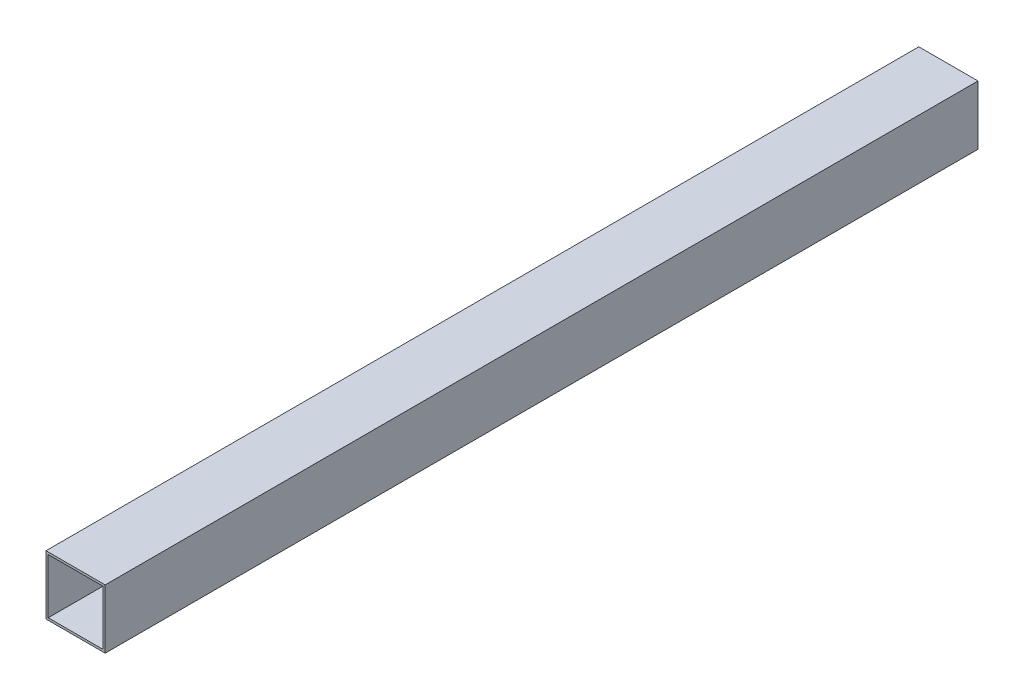
ISO-10303-21;
HEADER;
FILE_DESCRIPTION(('STEP AP214'),'2;1');
FILE_NAME('part.step','',(''),(''),'','','');
FILE_SCHEMA(('AUTOMOTIVE_DESIGN { 1 0 10303 214 1 1 1 1 }'));
ENDSEC;
DATA;
#1=APPLICATION_CONTEXT('core data for automotive mechanical design processes');
#2=APPLICATION_PROTOCOL_DEFINITION('international standard','automotive_design',2000,#1);
#3=PRODUCT_CONTEXT('',#1,'mechanical');
#4=PRODUCT('Part','Part','',(#3));
#5=PRODUCT_RELATED_PRODUCT_CATEGORY('part','',(#4));
#6=PRODUCT_DEFINITION_FORMATION('','',#4);
#7=PRODUCT_DEFINITION_CONTEXT('part definition',#1,'design');
#8=PRODUCT_DEFINITION('design','',#6,#7);
#9=PRODUCT_DEFINITION_SHAPE('','',#8);
#10=(LENGTH_UNIT() NAMED_UNIT(*) SI_UNIT(.MILLI.,.METRE.));
#11=(NAMED_UNIT(*) PLANE_ANGLE_UNIT() SI_UNIT($,.RADIAN.));
#12=(NAMED_UNIT(*) SI_UNIT($,.STERADIAN.) SOLID_ANGLE_UNIT());
#13=UNCERTAINTY_MEASURE_WITH_UNIT(LENGTH_MEASURE(1.E-05),#10,'distance_accuracy_value','');
#14=(GEOMETRIC_REPRESENTATION_CONTEXT(3) GLOBAL_UNCERTAINTY_ASSIGNED_CONTEXT((#13)) GLOBAL_UNIT_ASSIGNED_CONTEXT((#10,
#11,#12)) REPRESENTATION_CONTEXT('',''));
#15=CARTESIAN_POINT('',(0.,0.,0.));
#16=DIRECTION('',(0.,0.,1.));
#17=DIRECTION('',(1.,0.,0.));
#18=AXIS2_PLACEMENT_3D('',#15,#16,#17);
#19=CARTESIAN_POINT('',(20.,-20.,590.));
#20=DIRECTION('',(-1.,0.,0.));
#21=DIRECTION('',(0.,0.,1.));
#22=AXIS2_PLACEMENT_3D('',#19,#20,#21);
#23=PLANE('',#22);
#24=DIRECTION('',(0.,1.,0.));
#25=VECTOR('',#24,1.);
#26=CARTESIAN_POINT('',(20.,-20.,0.));
#27=LINE('',#26,#25);
#28=CARTESIAN_POINT('',(20.,-20.,0.));
#29=VERTEX_POINT('',#28);
#30=CARTESIAN_POINT('',(20.,20.,0.));
#31=VERTEX_POINT('',#30);
#32=EDGE_CURVE('E147',#29,#31,#27,.T.);
#33=ORIENTED_EDGE('',*,*,#32,.T.);
#34=DIRECTION('',(0.,0.,-1.));
#35=VECTOR('',#34,1.);
#36=CARTESIAN_POINT('',(20.,20.,590.));
#37=LINE('',#36,#35);
#38=CARTESIAN_POINT('',(20.,20.,590.));
#39=VERTEX_POINT('',#38);
#40=EDGE_CURVE('E11',#39,#31,#37,.T.);
#41=ORIENTED_EDGE('',*,*,#40,.F.);
#42=DIRECTION('',(0.,1.,0.));
#43=VECTOR('',#42,1.);
#44=CARTESIAN_POINT('',(20.,-20.,590.));
#45=LINE('',#44,#43);
#46=CARTESIAN_POINT('',(20.,-20.,590.));
#47=VERTEX_POINT('',#46);
#48=EDGE_CURVE('E153',#47,#39,#45,.T.);
#49=ORIENTED_EDGE('',*,*,#48,.F.);
#50=DIRECTION('',(0.,0.,-1.));
#51=VECTOR('',#50,1.);
#52=CARTESIAN_POINT('',(20.,-20.,590.));
#53=LINE('',#52,#51);
#54=EDGE_CURVE('E167',#47,#29,#53,.T.);
#55=ORIENTED_EDGE('',*,*,#54,.T.);
#56=EDGE_LOOP('',(#33,#41,#49,#55));
#57=FACE_BOUND('',#56,.T.);
#58=ADVANCED_FACE('F39',(#57),#23,.F.);
#59=CARTESIAN_POINT('',(-20.,20.,590.));
#60=DIRECTION('',(0.,-1.,0.));
#61=DIRECTION('',(0.,0.,-1.));
#62=AXIS2_PLACEMENT_3D('',#59,#60,#61);
#63=PLANE('',#62);
#64=DIRECTION('',(-1.,0.,0.));
#65=VECTOR('',#64,1.);
#66=CARTESIAN_POINT('',(-20.,20.,0.));
#67=LINE('',#66,#65);
#68=CARTESIAN_POINT('',(-20.,20.,0.));
#69=VERTEX_POINT('',#68);
#70=EDGE_CURVE('E171',#31,#69,#67,.T.);
#71=ORIENTED_EDGE('',*,*,#70,.T.);
#72=DIRECTION('',(0.,0.,-1.));
#73=VECTOR('',#72,1.);
#74=CARTESIAN_POINT('',(-20.,20.,590.));
#75=LINE('',#74,#73);
#76=CARTESIAN_POINT('',(-20.,20.,590.));
#77=VERTEX_POINT('',#76);
#78=EDGE_CURVE('E47',#77,#69,#75,.T.);
#79=ORIENTED_EDGE('',*,*,#78,.F.);
#80=DIRECTION('',(-1.,0.,0.));
#81=VECTOR('',#80,1.);
#82=CARTESIAN_POINT('',(-20.,20.,590.));
#83=LINE('',#82,#81);
#84=EDGE_CURVE('E157',#39,#77,#83,.T.);
#85=ORIENTED_EDGE('',*,*,#84,.F.);
#86=ORIENTED_EDGE('',*,*,#40,.T.);
#87=EDGE_LOOP('',(#71,#79,#85,#86));
#88=FACE_BOUND('',#87,.T.);
#89=ADVANCED_FACE('F205',(#88),#63,.F.);
#90=CARTESIAN_POINT('',(-20.,-20.,590.));
#91=DIRECTION('',(1.,0.,0.));
#92=DIRECTION('',(0.,0.,-1.));
#93=AXIS2_PLACEMENT_3D('',#90,#91,#92);
#94=PLANE('',#93);
#95=DIRECTION('',(0.,-1.,0.));
#96=VECTOR('',#95,1.);
#97=CARTESIAN_POINT('',(-20.,-20.,0.));
#98=LINE('',#97,#96);
#99=CARTESIAN_POINT('',(-20.,-20.,0.));
#100=VERTEX_POINT('',#99);
#101=EDGE_CURVE('E174',#69,#100,#98,.T.);
#102=ORIENTED_EDGE('',*,*,#101,.T.);
#103=DIRECTION('',(0.,0.,-1.));
#104=VECTOR('',#103,1.);
#105=CARTESIAN_POINT('',(-20.,-20.,590.));
#106=LINE('',#105,#104);
#107=CARTESIAN_POINT('',(-20.,-20.,590.));
#108=VERTEX_POINT('',#107);
#109=EDGE_CURVE('E182',#108,#100,#106,.T.);
#110=ORIENTED_EDGE('',*,*,#109,.F.);
#111=DIRECTION('',(0.,-1.,0.));
#112=VECTOR('',#111,1.);
#113=CARTESIAN_POINT('',(-20.,-20.,590.));
#114=LINE('',#113,#112);
#115=EDGE_CURVE('E161',#77,#108,#114,.T.);
#116=ORIENTED_EDGE('',*,*,#115,.F.);
#117=ORIENTED_EDGE('',*,*,#78,.T.);
#118=EDGE_LOOP('',(#102,#110,#116,#117));
#119=FACE_BOUND('',#118,.T.);
#120=ADVANCED_FACE('F191',(#119),#94,.F.);
#121=CARTESIAN_POINT('',(-20.,-20.,590.));
#122=DIRECTION('',(0.,1.,0.));
#123=DIRECTION('',(0.,0.,1.));
#124=AXIS2_PLACEMENT_3D('',#121,#122,#123);
#125=PLANE('',#124);
#126=DIRECTION('',(1.,0.,0.));
#127=VECTOR('',#126,1.);
#128=CARTESIAN_POINT('',(-20.,-20.,0.));
#129=LINE('',#128,#127);
#130=EDGE_CURVE('E158',#100,#29,#129,.T.);
#131=ORIENTED_EDGE('',*,*,#130,.T.);
#132=ORIENTED_EDGE('',*,*,#54,.F.);
#133=DIRECTION('',(1.,0.,0.));
#134=VECTOR('',#133,1.);
#135=CARTESIAN_POINT('',(-20.,-20.,590.));
#136=LINE('',#135,#134);
#137=EDGE_CURVE('E164',#108,#47,#136,.T.);
#138=ORIENTED_EDGE('',*,*,#137,.F.);
#139=ORIENTED_EDGE('',*,*,#109,.T.);
#140=EDGE_LOOP('',(#131,#132,#138,#139));
#141=FACE_BOUND('',#140,.T.);
#142=ADVANCED_FACE('F198',(#141),#125,.F.);
#143=CARTESIAN_POINT('',(0.,0.,590.));
#144=DIRECTION('',(0.,0.,-1.));
#145=DIRECTION('',(-1.,0.,0.));
#146=AXIS2_PLACEMENT_3D('',#143,#144,#145);
#147=PLANE('',#146);
#148=DIRECTION('',(-1.,0.,0.));
#149=VECTOR('',#148,1.);
#150=CARTESIAN_POINT('',(-18.5,18.5,590.));
#151=LINE('',#150,#149);
#152=CARTESIAN_POINT('',(18.5,18.5,590.));
#153=VERTEX_POINT('',#152);
#154=CARTESIAN_POINT('',(-18.5,18.5,590.));
#155=VERTEX_POINT('',#154);
#156=EDGE_CURVE('E138',#153,#155,#151,.T.);
#157=ORIENTED_EDGE('',*,*,#156,.F.);
#158=DIRECTION('',(0.,1.,0.));
#159=VECTOR('',#158,1.);
#160=CARTESIAN_POINT('',(18.5,-18.5,590.));
#161=LINE('',#160,#159);
#162=CARTESIAN_POINT('',(18.5,-18.5,590.));
#163=VERTEX_POINT('',#162);
#164=EDGE_CURVE('E54',#163,#153,#161,.T.);
#165=ORIENTED_EDGE('',*,*,#164,.F.);
#166=DIRECTION('',(1.,0.,0.));
#167=VECTOR('',#166,1.);
#168=CARTESIAN_POINT('',(-18.5,-18.5,590.));
#169=LINE('',#168,#167);
#170=CARTESIAN_POINT('',(-18.5,-18.5,590.));
#171=VERTEX_POINT('',#170);
#172=EDGE_CURVE('E125',#171,#163,#169,.T.);
#173=ORIENTED_EDGE('',*,*,#172,.F.);
#174=DIRECTION('',(0.,-1.,0.));
#175=VECTOR('',#174,1.);
#176=CARTESIAN_POINT('',(-18.5,-18.5,590.));
#177=LINE('',#176,#175);
#178=EDGE_CURVE('E129',#155,#171,#177,.T.);
#179=ORIENTED_EDGE('',*,*,#178,.F.);
#180=EDGE_LOOP('',(#157,#165,#173,#179));
#181=FACE_BOUND('',#180,.T.);
#182=ORIENTED_EDGE('',*,*,#48,.T.);
#183=ORIENTED_EDGE('',*,*,#84,.T.);
#184=ORIENTED_EDGE('',*,*,#115,.T.);
#185=ORIENTED_EDGE('',*,*,#137,.T.);
#186=EDGE_LOOP('',(#182,#183,#184,#185));
#187=FACE_BOUND('',#186,.T.);
#188=ADVANCED_FACE('F204',(#181,#187),#147,.F.);
#189=CARTESIAN_POINT('',(0.,0.,0.));
#190=DIRECTION('',(0.,0.,-1.));
#191=DIRECTION('',(-1.,0.,0.));
#192=AXIS2_PLACEMENT_3D('',#189,#190,#191);
#193=PLANE('',#192);
#194=DIRECTION('',(0.,1.,0.));
#195=VECTOR('',#194,1.);
#196=CARTESIAN_POINT('',(18.5,-18.5,0.));
#197=LINE('',#196,#195);
#198=CARTESIAN_POINT('',(18.5,-18.5,0.));
#199=VERTEX_POINT('',#198);
#200=CARTESIAN_POINT('',(18.5,18.5,0.));
#201=VERTEX_POINT('',#200);
#202=EDGE_CURVE('E106',#199,#201,#197,.T.);
#203=ORIENTED_EDGE('',*,*,#202,.T.);
#204=DIRECTION('',(-1.,0.,0.));
#205=VECTOR('',#204,1.);
#206=CARTESIAN_POINT('',(-18.5,18.5,0.));
#207=LINE('',#206,#205);
#208=CARTESIAN_POINT('',(-18.5,18.5,0.));
#209=VERTEX_POINT('',#208);
#210=EDGE_CURVE('E116',#201,#209,#207,.T.);
#211=ORIENTED_EDGE('',*,*,#210,.T.);
#212=DIRECTION('',(0.,-1.,0.));
#213=VECTOR('',#212,1.);
#214=CARTESIAN_POINT('',(-18.5,-18.5,0.));
#215=LINE('',#214,#213);
#216=CARTESIAN_POINT('',(-18.5,-18.5,0.));
#217=VERTEX_POINT('',#216);
#218=EDGE_CURVE('E62',#209,#217,#215,.T.);
#219=ORIENTED_EDGE('',*,*,#218,.T.);
#220=DIRECTION('',(1.,0.,0.));
#221=VECTOR('',#220,1.);
#222=CARTESIAN_POINT('',(-18.5,-18.5,0.));
#223=LINE('',#222,#221);
#224=EDGE_CURVE('E113',#217,#199,#223,.T.);
#225=ORIENTED_EDGE('',*,*,#224,.T.);
#226=EDGE_LOOP('',(#203,#211,#219,#225));
#227=FACE_BOUND('',#226,.T.);
#228=ORIENTED_EDGE('',*,*,#32,.F.);
#229=ORIENTED_EDGE('',*,*,#130,.F.);
#230=ORIENTED_EDGE('',*,*,#101,.F.);
#231=ORIENTED_EDGE('',*,*,#70,.F.);
#232=EDGE_LOOP('',(#228,#229,#230,#231));
#233=FACE_BOUND('',#232,.T.);
#234=ADVANCED_FACE('F121',(#227,#233),#193,.T.);
#235=CARTESIAN_POINT('',(18.5,-18.5,0.));
#236=DIRECTION('',(1.,0.,0.));
#237=DIRECTION('',(0.,0.,-1.));
#238=AXIS2_PLACEMENT_3D('',#235,#236,#237);
#239=PLANE('',#238);
#240=ORIENTED_EDGE('',*,*,#164,.T.);
#241=DIRECTION('',(0.,0.,1.));
#242=VECTOR('',#241,1.);
#243=CARTESIAN_POINT('',(18.5,18.5,0.));
#244=LINE('',#243,#242);
#245=EDGE_CURVE('E102',#201,#153,#244,.T.);
#246=ORIENTED_EDGE('',*,*,#245,.F.);
#247=ORIENTED_EDGE('',*,*,#202,.F.);
#248=DIRECTION('',(0.,0.,1.));
#249=VECTOR('',#248,1.);
#250=CARTESIAN_POINT('',(18.5,-18.5,0.));
#251=LINE('',#250,#249);
#252=EDGE_CURVE('E144',#199,#163,#251,.T.);
#253=ORIENTED_EDGE('',*,*,#252,.T.);
#254=EDGE_LOOP('',(#240,#246,#247,#253));
#255=FACE_BOUND('',#254,.T.);
#256=ADVANCED_FACE('F104',(#255),#239,.F.);
#257=CARTESIAN_POINT('',(-18.5,-18.5,0.));
#258=DIRECTION('',(0.,-1.,0.));
#259=DIRECTION('',(0.,0.,-1.));
#260=AXIS2_PLACEMENT_3D('',#257,#258,#259);
#261=PLANE('',#260);
#262=ORIENTED_EDGE('',*,*,#172,.T.);
#263=ORIENTED_EDGE('',*,*,#252,.F.);
#264=ORIENTED_EDGE('',*,*,#224,.F.);
#265=DIRECTION('',(0.,0.,1.));
#266=VECTOR('',#265,1.);
#267=CARTESIAN_POINT('',(-18.5,-18.5,0.));
#268=LINE('',#267,#266);
#269=EDGE_CURVE('E148',#217,#171,#268,.T.);
#270=ORIENTED_EDGE('',*,*,#269,.T.);
#271=EDGE_LOOP('',(#262,#263,#264,#270));
#272=FACE_BOUND('',#271,.T.);
#273=ADVANCED_FACE('F222',(#272),#261,.F.);
#274=CARTESIAN_POINT('',(-18.5,-18.5,0.));
#275=DIRECTION('',(-1.,0.,0.));
#276=DIRECTION('',(0.,0.,1.));
#277=AXIS2_PLACEMENT_3D('',#274,#275,#276);
#278=PLANE('',#277);
#279=ORIENTED_EDGE('',*,*,#178,.T.);
#280=ORIENTED_EDGE('',*,*,#269,.F.);
#281=ORIENTED_EDGE('',*,*,#218,.F.);
#282=DIRECTION('',(0.,0.,1.));
#283=VECTOR('',#282,1.);
#284=CARTESIAN_POINT('',(-18.5,18.5,0.));
#285=LINE('',#284,#283);
#286=EDGE_CURVE('E112',#209,#155,#285,.T.);
#287=ORIENTED_EDGE('',*,*,#286,.T.);
#288=EDGE_LOOP('',(#279,#280,#281,#287));
#289=FACE_BOUND('',#288,.T.);
#290=ADVANCED_FACE('F225',(#289),#278,.F.);
#291=CARTESIAN_POINT('',(-18.5,18.5,0.));
#292=DIRECTION('',(0.,1.,0.));
#293=DIRECTION('',(0.,0.,1.));
#294=AXIS2_PLACEMENT_3D('',#291,#292,#293);
#295=PLANE('',#294);
#296=ORIENTED_EDGE('',*,*,#156,.T.);
#297=ORIENTED_EDGE('',*,*,#286,.F.);
#298=ORIENTED_EDGE('',*,*,#210,.F.);
#299=ORIENTED_EDGE('',*,*,#245,.T.);
#300=EDGE_LOOP('',(#296,#297,#298,#299));
#301=FACE_BOUND('',#300,.T.);
#302=ADVANCED_FACE('F117',(#301),#295,.F.);
#303=CLOSED_SHELL('',(#58,#89,#120,#142,#188,#234,#256,#273,#290,#302));
#304=MANIFOLD_SOLID_BREP('B2',#303);
#305=ADVANCED_BREP_SHAPE_REPRESENTATION('',(#18,#304),#14);
#306=SHAPE_DEFINITION_REPRESENTATION(#9,#305);
ENDSEC;
END-ISO-10303-21;
